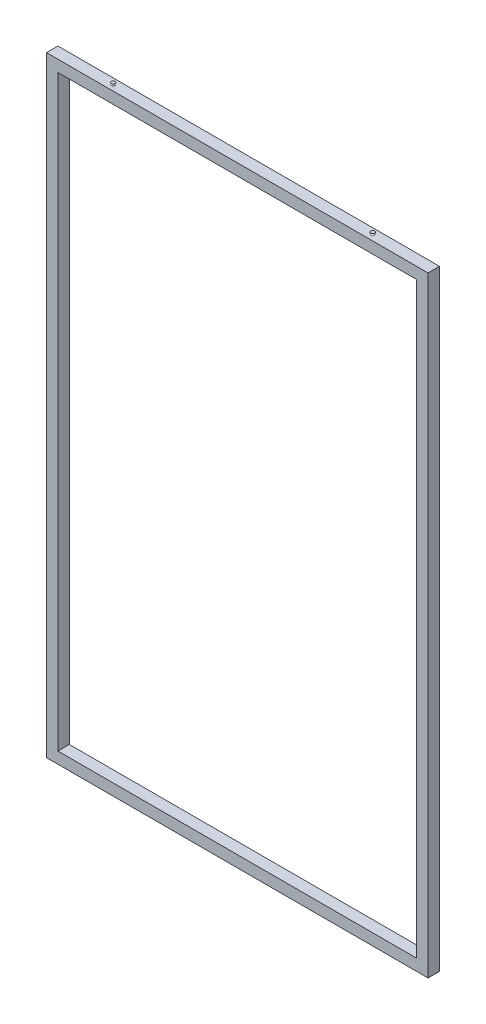
ISO-10303-21;
HEADER;
FILE_DESCRIPTION(('STEP AP214'),'2;1');
FILE_NAME('part.step','',(''),(''),'','','');
FILE_SCHEMA(('AUTOMOTIVE_DESIGN { 1 0 10303 214 1 1 1 1 }'));
ENDSEC;
DATA;
#1=APPLICATION_CONTEXT('core data for automotive mechanical design processes');
#2=APPLICATION_PROTOCOL_DEFINITION('international standard','automotive_design',2000,#1);
#3=PRODUCT_CONTEXT('',#1,'mechanical');
#4=PRODUCT('Part','Part','',(#3));
#5=PRODUCT_RELATED_PRODUCT_CATEGORY('part','',(#4));
#6=PRODUCT_DEFINITION_FORMATION('','',#4);
#7=PRODUCT_DEFINITION_CONTEXT('part definition',#1,'design');
#8=PRODUCT_DEFINITION('design','',#6,#7);
#9=PRODUCT_DEFINITION_SHAPE('','',#8);
#10=(LENGTH_UNIT() NAMED_UNIT(*) SI_UNIT(.MILLI.,.METRE.));
#11=(NAMED_UNIT(*) PLANE_ANGLE_UNIT() SI_UNIT($,.RADIAN.));
#12=(NAMED_UNIT(*) SI_UNIT($,.STERADIAN.) SOLID_ANGLE_UNIT());
#13=UNCERTAINTY_MEASURE_WITH_UNIT(LENGTH_MEASURE(1.E-05),#10,'distance_accuracy_value','');
#14=(GEOMETRIC_REPRESENTATION_CONTEXT(3) GLOBAL_UNCERTAINTY_ASSIGNED_CONTEXT((#13)) GLOBAL_UNIT_ASSIGNED_CONTEXT((#10,
#11,#12)) REPRESENTATION_CONTEXT('',''));
#15=CARTESIAN_POINT('',(0.,0.,0.));
#16=DIRECTION('',(0.,0.,1.));
#17=DIRECTION('',(1.,0.,0.));
#18=AXIS2_PLACEMENT_3D('',#15,#16,#17);
#19=CARTESIAN_POINT('',(0.,0.,15.));
#20=DIRECTION('',(0.,0.,1.));
#21=DIRECTION('',(1.,0.,0.));
#22=AXIS2_PLACEMENT_3D('',#19,#20,#21);
#23=PLANE('',#22);
#24=DIRECTION('',(0.,1.,0.));
#25=VECTOR('',#24,1.);
#26=CARTESIAN_POINT('',(500.,800.,15.));
#27=LINE('',#26,#25);
#28=CARTESIAN_POINT('',(500.,-800.,15.));
#29=VERTEX_POINT('',#28);
#30=CARTESIAN_POINT('',(500.,800.,15.));
#31=VERTEX_POINT('',#30);
#32=EDGE_CURVE('E310',#29,#31,#27,.T.);
#33=ORIENTED_EDGE('',*,*,#32,.T.);
#34=DIRECTION('',(-1.,0.,0.));
#35=VECTOR('',#34,1.);
#36=CARTESIAN_POINT('',(-500.,800.,15.));
#37=LINE('',#36,#35);
#38=CARTESIAN_POINT('',(-500.,800.,15.));
#39=VERTEX_POINT('',#38);
#40=EDGE_CURVE('E313',#31,#39,#37,.T.);
#41=ORIENTED_EDGE('',*,*,#40,.T.);
#42=DIRECTION('',(0.,-1.,0.));
#43=VECTOR('',#42,1.);
#44=CARTESIAN_POINT('',(-500.,800.,15.));
#45=LINE('',#44,#43);
#46=CARTESIAN_POINT('',(-500.,-800.,15.));
#47=VERTEX_POINT('',#46);
#48=EDGE_CURVE('E316',#39,#47,#45,.T.);
#49=ORIENTED_EDGE('',*,*,#48,.T.);
#50=DIRECTION('',(1.,0.,0.));
#51=VECTOR('',#50,1.);
#52=CARTESIAN_POINT('',(-500.,-800.,15.));
#53=LINE('',#52,#51);
#54=EDGE_CURVE('E318',#47,#29,#53,.T.);
#55=ORIENTED_EDGE('',*,*,#54,.T.);
#56=EDGE_LOOP('',(#33,#41,#49,#55));
#57=FACE_BOUND('',#56,.T.);
#58=DIRECTION('',(1.,0.,0.));
#59=VECTOR('',#58,1.);
#60=CARTESIAN_POINT('',(-470.,-770.,15.));
#61=LINE('',#60,#59);
#62=CARTESIAN_POINT('',(-470.,-770.,15.));
#63=VERTEX_POINT('',#62);
#64=CARTESIAN_POINT('',(470.,-770.,15.));
#65=VERTEX_POINT('',#64);
#66=EDGE_CURVE('E288',#63,#65,#61,.T.);
#67=ORIENTED_EDGE('',*,*,#66,.F.);
#68=DIRECTION('',(0.,-1.,0.));
#69=VECTOR('',#68,1.);
#70=CARTESIAN_POINT('',(-470.,770.,15.));
#71=LINE('',#70,#69);
#72=CARTESIAN_POINT('',(-470.,770.,15.));
#73=VERTEX_POINT('',#72);
#74=EDGE_CURVE('E286',#73,#63,#71,.T.);
#75=ORIENTED_EDGE('',*,*,#74,.F.);
#76=DIRECTION('',(-1.,0.,0.));
#77=VECTOR('',#76,1.);
#78=CARTESIAN_POINT('',(-470.,770.,15.));
#79=LINE('',#78,#77);
#80=CARTESIAN_POINT('',(470.,770.,15.));
#81=VERTEX_POINT('',#80);
#82=EDGE_CURVE('E293',#81,#73,#79,.T.);
#83=ORIENTED_EDGE('',*,*,#82,.F.);
#84=DIRECTION('',(0.,1.,0.));
#85=VECTOR('',#84,1.);
#86=CARTESIAN_POINT('',(470.,770.,15.));
#87=LINE('',#86,#85);
#88=EDGE_CURVE('E291',#65,#81,#87,.T.);
#89=ORIENTED_EDGE('',*,*,#88,.F.);
#90=EDGE_LOOP('',(#67,#75,#83,#89));
#91=FACE_BOUND('',#90,.T.);
#92=ADVANCED_FACE('F47',(#57,#91),#23,.T.);
#93=CARTESIAN_POINT('',(0.,0.,-15.));
#94=DIRECTION('',(0.,0.,1.));
#95=DIRECTION('',(1.,0.,0.));
#96=AXIS2_PLACEMENT_3D('',#93,#94,#95);
#97=PLANE('',#96);
#98=DIRECTION('',(0.,1.,0.));
#99=VECTOR('',#98,1.);
#100=CARTESIAN_POINT('',(500.,800.,-15.));
#101=LINE('',#100,#99);
#102=CARTESIAN_POINT('',(500.,-800.,-15.));
#103=VERTEX_POINT('',#102);
#104=CARTESIAN_POINT('',(500.,800.,-15.));
#105=VERTEX_POINT('',#104);
#106=EDGE_CURVE('E309',#103,#105,#101,.T.);
#107=ORIENTED_EDGE('',*,*,#106,.F.);
#108=DIRECTION('',(1.,0.,0.));
#109=VECTOR('',#108,1.);
#110=CARTESIAN_POINT('',(-500.,-800.,-15.));
#111=LINE('',#110,#109);
#112=CARTESIAN_POINT('',(-500.,-800.,-15.));
#113=VERTEX_POINT('',#112);
#114=EDGE_CURVE('E314',#113,#103,#111,.T.);
#115=ORIENTED_EDGE('',*,*,#114,.F.);
#116=DIRECTION('',(0.,-1.,0.));
#117=VECTOR('',#116,1.);
#118=CARTESIAN_POINT('',(-500.,800.,-15.));
#119=LINE('',#118,#117);
#120=CARTESIAN_POINT('',(-500.,800.,-15.));
#121=VERTEX_POINT('',#120);
#122=EDGE_CURVE('E325',#121,#113,#119,.T.);
#123=ORIENTED_EDGE('',*,*,#122,.F.);
#124=DIRECTION('',(-1.,0.,0.));
#125=VECTOR('',#124,1.);
#126=CARTESIAN_POINT('',(-500.,800.,-15.));
#127=LINE('',#126,#125);
#128=EDGE_CURVE('E323',#105,#121,#127,.T.);
#129=ORIENTED_EDGE('',*,*,#128,.F.);
#130=EDGE_LOOP('',(#107,#115,#123,#129));
#131=FACE_BOUND('',#130,.T.);
#132=DIRECTION('',(0.,-1.,0.));
#133=VECTOR('',#132,1.);
#134=CARTESIAN_POINT('',(-470.,770.,-15.));
#135=LINE('',#134,#133);
#136=CARTESIAN_POINT('',(-470.,770.,-15.));
#137=VERTEX_POINT('',#136);
#138=CARTESIAN_POINT('',(-470.,-770.,-15.));
#139=VERTEX_POINT('',#138);
#140=EDGE_CURVE('E70',#137,#139,#135,.T.);
#141=ORIENTED_EDGE('',*,*,#140,.T.);
#142=DIRECTION('',(1.,0.,0.));
#143=VECTOR('',#142,1.);
#144=CARTESIAN_POINT('',(-470.,-770.,-15.));
#145=LINE('',#144,#143);
#146=CARTESIAN_POINT('',(470.,-770.,-15.));
#147=VERTEX_POINT('',#146);
#148=EDGE_CURVE('E214',#139,#147,#145,.T.);
#149=ORIENTED_EDGE('',*,*,#148,.T.);
#150=DIRECTION('',(0.,1.,0.));
#151=VECTOR('',#150,1.);
#152=CARTESIAN_POINT('',(470.,770.,-15.));
#153=LINE('',#152,#151);
#154=CARTESIAN_POINT('',(470.,770.,-15.));
#155=VERTEX_POINT('',#154);
#156=EDGE_CURVE('E298',#147,#155,#153,.T.);
#157=ORIENTED_EDGE('',*,*,#156,.T.);
#158=DIRECTION('',(-1.,0.,0.));
#159=VECTOR('',#158,1.);
#160=CARTESIAN_POINT('',(-470.,770.,-15.));
#161=LINE('',#160,#159);
#162=EDGE_CURVE('E289',#155,#137,#161,.T.);
#163=ORIENTED_EDGE('',*,*,#162,.T.);
#164=EDGE_LOOP('',(#141,#149,#157,#163));
#165=FACE_BOUND('',#164,.T.);
#166=ADVANCED_FACE('F343',(#131,#165),#97,.F.);
#167=CARTESIAN_POINT('',(500.,800.,15.));
#168=DIRECTION('',(-1.,0.,0.));
#169=DIRECTION('',(0.,-1.,0.));
#170=AXIS2_PLACEMENT_3D('',#167,#168,#169);
#171=PLANE('',#170);
#172=ORIENTED_EDGE('',*,*,#106,.T.);
#173=DIRECTION('',(0.,0.,-1.));
#174=VECTOR('',#173,1.);
#175=CARTESIAN_POINT('',(500.,800.,15.));
#176=LINE('',#175,#174);
#177=EDGE_CURVE('E13',#31,#105,#176,.T.);
#178=ORIENTED_EDGE('',*,*,#177,.F.);
#179=ORIENTED_EDGE('',*,*,#32,.F.);
#180=DIRECTION('',(0.,0.,-1.));
#181=VECTOR('',#180,1.);
#182=CARTESIAN_POINT('',(500.,-800.,15.));
#183=LINE('',#182,#181);
#184=EDGE_CURVE('E320',#29,#103,#183,.T.);
#185=ORIENTED_EDGE('',*,*,#184,.T.);
#186=EDGE_LOOP('',(#172,#178,#179,#185));
#187=FACE_BOUND('',#186,.T.);
#188=ADVANCED_FACE('F49',(#187),#171,.F.);
#189=CARTESIAN_POINT('',(-500.,800.,15.));
#190=DIRECTION('',(0.,-1.,0.));
#191=DIRECTION('',(0.,0.,-1.));
#192=AXIS2_PLACEMENT_3D('',#189,#190,#191);
#193=PLANE('',#192);
#194=CARTESIAN_POINT('',(340.,800.,0.));
#195=DIRECTION('',(0.,1.,0.));
#196=DIRECTION('',(0.,0.,-1.));
#197=AXIS2_PLACEMENT_3D('',#194,#195,#196);
#198=CIRCLE('',#197,5.);
#199=CARTESIAN_POINT('',(340.,800.,-5.));
#200=VERTEX_POINT('',#199);
#201=EDGE_CURVE('E485',#200,#200,#198,.T.);
#202=ORIENTED_EDGE('',*,*,#201,.F.);
#203=EDGE_LOOP('',(#202));
#204=FACE_BOUND('',#203,.T.);
#205=CARTESIAN_POINT('',(-340.,800.,0.));
#206=DIRECTION('',(0.,-1.,0.));
#207=DIRECTION('',(0.,0.,-1.));
#208=AXIS2_PLACEMENT_3D('',#205,#206,#207);
#209=CIRCLE('',#208,5.);
#210=CARTESIAN_POINT('',(-340.,800.,-5.));
#211=VERTEX_POINT('',#210);
#212=EDGE_CURVE('E489',#211,#211,#209,.T.);
#213=ORIENTED_EDGE('',*,*,#212,.T.);
#214=EDGE_LOOP('',(#213));
#215=FACE_BOUND('',#214,.T.);
#216=ORIENTED_EDGE('',*,*,#128,.T.);
#217=DIRECTION('',(0.,0.,-1.));
#218=VECTOR('',#217,1.);
#219=CARTESIAN_POINT('',(-500.,800.,15.));
#220=LINE('',#219,#218);
#221=EDGE_CURVE('E55',#39,#121,#220,.T.);
#222=ORIENTED_EDGE('',*,*,#221,.F.);
#223=ORIENTED_EDGE('',*,*,#40,.F.);
#224=ORIENTED_EDGE('',*,*,#177,.T.);
#225=EDGE_LOOP('',(#216,#222,#223,#224));
#226=FACE_BOUND('',#225,.T.);
#227=ADVANCED_FACE('F354',(#204,#215,#226),#193,.F.);
#228=CARTESIAN_POINT('',(-500.,800.,15.));
#229=DIRECTION('',(1.,0.,0.));
#230=DIRECTION('',(0.,1.,0.));
#231=AXIS2_PLACEMENT_3D('',#228,#229,#230);
#232=PLANE('',#231);
#233=ORIENTED_EDGE('',*,*,#122,.T.);
#234=DIRECTION('',(0.,0.,-1.));
#235=VECTOR('',#234,1.);
#236=CARTESIAN_POINT('',(-500.,-800.,15.));
#237=LINE('',#236,#235);
#238=EDGE_CURVE('E330',#47,#113,#237,.T.);
#239=ORIENTED_EDGE('',*,*,#238,.F.);
#240=ORIENTED_EDGE('',*,*,#48,.F.);
#241=ORIENTED_EDGE('',*,*,#221,.T.);
#242=EDGE_LOOP('',(#233,#239,#240,#241));
#243=FACE_BOUND('',#242,.T.);
#244=ADVANCED_FACE('F337',(#243),#232,.F.);
#245=CARTESIAN_POINT('',(-500.,-800.,15.));
#246=DIRECTION('',(0.,1.,0.));
#247=DIRECTION('',(0.,0.,1.));
#248=AXIS2_PLACEMENT_3D('',#245,#246,#247);
#249=PLANE('',#248);
#250=ORIENTED_EDGE('',*,*,#114,.T.);
#251=ORIENTED_EDGE('',*,*,#184,.F.);
#252=ORIENTED_EDGE('',*,*,#54,.F.);
#253=ORIENTED_EDGE('',*,*,#238,.T.);
#254=EDGE_LOOP('',(#250,#251,#252,#253));
#255=FACE_BOUND('',#254,.T.);
#256=ADVANCED_FACE('F347',(#255),#249,.F.);
#257=CARTESIAN_POINT('',(-470.,770.,15.));
#258=DIRECTION('',(1.,0.,0.));
#259=DIRECTION('',(0.,1.,0.));
#260=AXIS2_PLACEMENT_3D('',#257,#258,#259);
#261=PLANE('',#260);
#262=ORIENTED_EDGE('',*,*,#140,.F.);
#263=DIRECTION('',(0.,0.,-1.));
#264=VECTOR('',#263,1.);
#265=CARTESIAN_POINT('',(-470.,770.,15.));
#266=LINE('',#265,#264);
#267=EDGE_CURVE('E294',#73,#137,#266,.T.);
#268=ORIENTED_EDGE('',*,*,#267,.F.);
#269=ORIENTED_EDGE('',*,*,#74,.T.);
#270=DIRECTION('',(0.,0.,-1.));
#271=VECTOR('',#270,1.);
#272=CARTESIAN_POINT('',(-470.,-770.,15.));
#273=LINE('',#272,#271);
#274=EDGE_CURVE('E307',#63,#139,#273,.T.);
#275=ORIENTED_EDGE('',*,*,#274,.T.);
#276=EDGE_LOOP('',(#262,#268,#269,#275));
#277=FACE_BOUND('',#276,.T.);
#278=ADVANCED_FACE('F371',(#277),#261,.T.);
#279=CARTESIAN_POINT('',(-470.,-770.,15.));
#280=DIRECTION('',(0.,1.,0.));
#281=DIRECTION('',(0.,0.,1.));
#282=AXIS2_PLACEMENT_3D('',#279,#280,#281);
#283=PLANE('',#282);
#284=ORIENTED_EDGE('',*,*,#148,.F.);
#285=ORIENTED_EDGE('',*,*,#274,.F.);
#286=ORIENTED_EDGE('',*,*,#66,.T.);
#287=DIRECTION('',(0.,0.,-1.));
#288=VECTOR('',#287,1.);
#289=CARTESIAN_POINT('',(470.,-770.,15.));
#290=LINE('',#289,#288);
#291=EDGE_CURVE('E305',#65,#147,#290,.T.);
#292=ORIENTED_EDGE('',*,*,#291,.T.);
#293=EDGE_LOOP('',(#284,#285,#286,#292));
#294=FACE_BOUND('',#293,.T.);
#295=ADVANCED_FACE('F378',(#294),#283,.T.);
#296=CARTESIAN_POINT('',(470.,770.,15.));
#297=DIRECTION('',(-1.,0.,0.));
#298=DIRECTION('',(0.,-1.,0.));
#299=AXIS2_PLACEMENT_3D('',#296,#297,#298);
#300=PLANE('',#299);
#301=ORIENTED_EDGE('',*,*,#156,.F.);
#302=ORIENTED_EDGE('',*,*,#291,.F.);
#303=ORIENTED_EDGE('',*,*,#88,.T.);
#304=DIRECTION('',(0.,0.,-1.));
#305=VECTOR('',#304,1.);
#306=CARTESIAN_POINT('',(470.,770.,15.));
#307=LINE('',#306,#305);
#308=EDGE_CURVE('E62',#81,#155,#307,.T.);
#309=ORIENTED_EDGE('',*,*,#308,.T.);
#310=EDGE_LOOP('',(#301,#302,#303,#309));
#311=FACE_BOUND('',#310,.T.);
#312=ADVANCED_FACE('F382',(#311),#300,.T.);
#313=CARTESIAN_POINT('',(-470.,770.,15.));
#314=DIRECTION('',(0.,-1.,0.));
#315=DIRECTION('',(0.,0.,-1.));
#316=AXIS2_PLACEMENT_3D('',#313,#314,#315);
#317=PLANE('',#316);
#318=ORIENTED_EDGE('',*,*,#162,.F.);
#319=ORIENTED_EDGE('',*,*,#308,.F.);
#320=ORIENTED_EDGE('',*,*,#82,.T.);
#321=ORIENTED_EDGE('',*,*,#267,.T.);
#322=EDGE_LOOP('',(#318,#319,#320,#321));
#323=FACE_BOUND('',#322,.T.);
#324=ADVANCED_FACE('F387',(#323),#317,.T.);
#325=CARTESIAN_POINT('',(-345.,805.,0.));
#326=DIRECTION('',(0.,-1.,0.));
#327=DIRECTION('',(0.,0.,-1.));
#328=AXIS2_PLACEMENT_3D('',#325,#326,#327);
#329=PLANE('',#328);
#330=CARTESIAN_POINT('',(-340.,805.,0.));
#331=DIRECTION('',(0.,-1.,0.));
#332=DIRECTION('',(0.,0.,-1.));
#333=AXIS2_PLACEMENT_3D('',#330,#331,#332);
#334=CIRCLE('',#333,5.);
#335=CARTESIAN_POINT('',(-340.,805.,-5.));
#336=VERTEX_POINT('',#335);
#337=EDGE_CURVE('E278',#336,#336,#334,.T.);
#338=ORIENTED_EDGE('',*,*,#337,.F.);
#339=EDGE_LOOP('',(#338));
#340=FACE_BOUND('',#339,.T.);
#341=ADVANCED_FACE('F393',(#340),#329,.F.);
#342=CARTESIAN_POINT('',(-340.,802.5,0.));
#343=DIRECTION('',(0.,-1.,0.));
#344=DIRECTION('',(0.,0.,-1.));
#345=AXIS2_PLACEMENT_3D('',#342,#343,#344);
#346=TOROIDAL_SURFACE('',#345,5.,2.49999999999995);
#347=ORIENTED_EDGE('',*,*,#212,.F.);
#348=EDGE_LOOP('',(#347));
#349=FACE_BOUND('',#348,.T.);
#350=ORIENTED_EDGE('',*,*,#337,.T.);
#351=EDGE_LOOP('',(#350));
#352=FACE_BOUND('',#351,.T.);
#353=ADVANCED_FACE('F469',(#349,#352),#346,.F.);
#354=CARTESIAN_POINT('',(345.,805.,0.));
#355=DIRECTION('',(0.,-1.,0.));
#356=DIRECTION('',(0.,0.,-1.));
#357=AXIS2_PLACEMENT_3D('',#354,#355,#356);
#358=PLANE('',#357);
#359=CARTESIAN_POINT('',(340.,805.,0.));
#360=DIRECTION('',(0.,1.,0.));
#361=DIRECTION('',(0.,0.,-1.));
#362=AXIS2_PLACEMENT_3D('',#359,#360,#361);
#363=CIRCLE('',#362,5.);
#364=CARTESIAN_POINT('',(340.,805.,-5.));
#365=VERTEX_POINT('',#364);
#366=EDGE_CURVE('E488',#365,#365,#363,.T.);
#367=ORIENTED_EDGE('',*,*,#366,.T.);
#368=EDGE_LOOP('',(#367));
#369=FACE_BOUND('',#368,.T.);
#370=ADVANCED_FACE('F473',(#369),#358,.F.);
#371=CARTESIAN_POINT('',(340.,802.5,0.));
#372=DIRECTION('',(0.,-1.,0.));
#373=DIRECTION('',(0.,0.,-1.));
#374=AXIS2_PLACEMENT_3D('',#371,#372,#373);
#375=TOROIDAL_SURFACE('',#374,5.,2.49999999999995);
#376=ORIENTED_EDGE('',*,*,#201,.T.);
#377=EDGE_LOOP('',(#376));
#378=FACE_BOUND('',#377,.T.);
#379=ORIENTED_EDGE('',*,*,#366,.F.);
#380=EDGE_LOOP('',(#379));
#381=FACE_BOUND('',#380,.T.);
#382=ADVANCED_FACE('F477',(#378,#381),#375,.F.);
#383=CLOSED_SHELL('',(#92,#166,#188,#227,#244,#256,#278,#295,#312,#324,#341,#353,#370,#382));
#384=CARTESIAN_POINT('',(-498.,-799.4,13.));
#385=DIRECTION('',(0.,0.,1.));
#386=DIRECTION('',(1.,0.,0.));
#387=AXIS2_PLACEMENT_3D('',#384,#385,#386);
#388=PLANE('',#387);
#389=DIRECTION('',(0.,1.,0.));
#390=VECTOR('',#389,1.);
#391=CARTESIAN_POINT('',(-472.,-799.4,13.));
#392=LINE('',#391,#390);
#393=CARTESIAN_POINT('',(-472.,-772.,13.));
#394=VERTEX_POINT('',#393);
#395=CARTESIAN_POINT('',(-472.,772.,13.));
#396=VERTEX_POINT('',#395);
#397=EDGE_CURVE('E247',#394,#396,#392,.T.);
#398=ORIENTED_EDGE('',*,*,#397,.F.);
#399=DIRECTION('',(-0.707106781186548,-0.707106781186548,0.));
#400=VECTOR('',#399,1.);
#401=CARTESIAN_POINT('',(0.700000000000089,-299.3,13.));
#402=LINE('',#401,#400);
#403=CARTESIAN_POINT('',(-498.,-798.,13.));
#404=VERTEX_POINT('',#403);
#405=EDGE_CURVE('E225',#394,#404,#402,.T.);
#406=ORIENTED_EDGE('',*,*,#405,.T.);
#407=DIRECTION('',(0.,1.,0.));
#408=VECTOR('',#407,1.);
#409=CARTESIAN_POINT('',(-498.,-799.4,13.));
#410=LINE('',#409,#408);
#411=CARTESIAN_POINT('',(-498.,798.,13.));
#412=VERTEX_POINT('',#411);
#413=EDGE_CURVE('E274',#404,#412,#410,.T.);
#414=ORIENTED_EDGE('',*,*,#413,.T.);
#415=DIRECTION('',(-0.707106781186548,0.707106781186548,0.));
#416=VECTOR('',#415,1.);
#417=CARTESIAN_POINT('',(-498.7,798.7,13.));
#418=LINE('',#417,#416);
#419=EDGE_CURVE('E254',#396,#412,#418,.T.);
#420=ORIENTED_EDGE('',*,*,#419,.F.);
#421=EDGE_LOOP('',(#398,#406,#414,#420));
#422=FACE_BOUND('',#421,.T.);
#423=ADVANCED_FACE('F394',(#422),#388,.F.);
#424=CARTESIAN_POINT('',(-498.,-799.4,13.));
#425=DIRECTION('',(-1.,0.,0.));
#426=DIRECTION('',(0.,0.,1.));
#427=AXIS2_PLACEMENT_3D('',#424,#425,#426);
#428=PLANE('',#427);
#429=ORIENTED_EDGE('',*,*,#413,.F.);
#430=DIRECTION('',(0.,0.,-1.));
#431=VECTOR('',#430,1.);
#432=CARTESIAN_POINT('',(-498.,-798.,13.));
#433=LINE('',#432,#431);
#434=CARTESIAN_POINT('',(-498.,-798.,-13.));
#435=VERTEX_POINT('',#434);
#436=EDGE_CURVE('E222',#404,#435,#433,.T.);
#437=ORIENTED_EDGE('',*,*,#436,.T.);
#438=DIRECTION('',(0.,1.,0.));
#439=VECTOR('',#438,1.);
#440=CARTESIAN_POINT('',(-498.,-799.4,-13.));
#441=LINE('',#440,#439);
#442=CARTESIAN_POINT('',(-498.,798.,-13.));
#443=VERTEX_POINT('',#442);
#444=EDGE_CURVE('E277',#435,#443,#441,.T.);
#445=ORIENTED_EDGE('',*,*,#444,.T.);
#446=DIRECTION('',(0.,0.,-1.));
#447=VECTOR('',#446,1.);
#448=CARTESIAN_POINT('',(-498.,798.,13.));
#449=LINE('',#448,#447);
#450=EDGE_CURVE('E256',#412,#443,#449,.T.);
#451=ORIENTED_EDGE('',*,*,#450,.F.);
#452=EDGE_LOOP('',(#429,#437,#445,#451));
#453=FACE_BOUND('',#452,.T.);
#454=ADVANCED_FACE('F397',(#453),#428,.F.);
#455=CARTESIAN_POINT('',(-498.,-799.4,-13.));
#456=DIRECTION('',(0.,0.,-1.));
#457=DIRECTION('',(-1.,0.,0.));
#458=AXIS2_PLACEMENT_3D('',#455,#456,#457);
#459=PLANE('',#458);
#460=ORIENTED_EDGE('',*,*,#444,.F.);
#461=DIRECTION('',(0.707106781186548,0.707106781186548,0.));
#462=VECTOR('',#461,1.);
#463=CARTESIAN_POINT('',(0.700000000000089,-299.3,-13.));
#464=LINE('',#463,#462);
#465=CARTESIAN_POINT('',(-472.,-772.,-13.));
#466=VERTEX_POINT('',#465);
#467=EDGE_CURVE('E207',#435,#466,#464,.T.);
#468=ORIENTED_EDGE('',*,*,#467,.T.);
#469=DIRECTION('',(0.,1.,0.));
#470=VECTOR('',#469,1.);
#471=CARTESIAN_POINT('',(-472.,-799.4,-13.));
#472=LINE('',#471,#470);
#473=CARTESIAN_POINT('',(-472.,772.,-13.));
#474=VERTEX_POINT('',#473);
#475=EDGE_CURVE('E281',#466,#474,#472,.T.);
#476=ORIENTED_EDGE('',*,*,#475,.T.);
#477=DIRECTION('',(0.707106781186548,-0.707106781186548,0.));
#478=VECTOR('',#477,1.);
#479=CARTESIAN_POINT('',(-498.7,798.7,-13.));
#480=LINE('',#479,#478);
#481=EDGE_CURVE('E258',#443,#474,#480,.T.);
#482=ORIENTED_EDGE('',*,*,#481,.F.);
#483=EDGE_LOOP('',(#460,#468,#476,#482));
#484=FACE_BOUND('',#483,.T.);
#485=ADVANCED_FACE('F402',(#484),#459,.F.);
#486=CARTESIAN_POINT('',(-472.,-799.4,13.));
#487=DIRECTION('',(1.,0.,0.));
#488=DIRECTION('',(0.,0.,-1.));
#489=AXIS2_PLACEMENT_3D('',#486,#487,#488);
#490=PLANE('',#489);
#491=ORIENTED_EDGE('',*,*,#475,.F.);
#492=DIRECTION('',(0.,0.,1.));
#493=VECTOR('',#492,1.);
#494=CARTESIAN_POINT('',(-472.,-772.,13.));
#495=LINE('',#494,#493);
#496=EDGE_CURVE('E228',#466,#394,#495,.T.);
#497=ORIENTED_EDGE('',*,*,#496,.T.);
#498=ORIENTED_EDGE('',*,*,#397,.T.);
#499=DIRECTION('',(0.,0.,1.));
#500=VECTOR('',#499,1.);
#501=CARTESIAN_POINT('',(-472.,772.,13.));
#502=LINE('',#501,#500);
#503=EDGE_CURVE('E233',#474,#396,#502,.T.);
#504=ORIENTED_EDGE('',*,*,#503,.F.);
#505=EDGE_LOOP('',(#491,#497,#498,#504));
#506=FACE_BOUND('',#505,.T.);
#507=ADVANCED_FACE('F406',(#506),#490,.F.);
#508=CARTESIAN_POINT('',(-499.4,772.,13.));
#509=DIRECTION('',(0.,-1.,0.));
#510=DIRECTION('',(0.,0.,-1.));
#511=AXIS2_PLACEMENT_3D('',#508,#509,#510);
#512=PLANE('',#511);
#513=ORIENTED_EDGE('',*,*,#503,.T.);
#514=DIRECTION('',(1.,0.,0.));
#515=VECTOR('',#514,1.);
#516=CARTESIAN_POINT('',(-499.4,772.,13.));
#517=LINE('',#516,#515);
#518=CARTESIAN_POINT('',(0.,772.,13.));
#519=VERTEX_POINT('',#518);
#520=EDGE_CURVE('E244',#396,#519,#517,.T.);
#521=ORIENTED_EDGE('',*,*,#520,.T.);
#522=DIRECTION('',(0.,0.,-1.));
#523=VECTOR('',#522,1.);
#524=CARTESIAN_POINT('',(0.,772.,13.));
#525=LINE('',#524,#523);
#526=CARTESIAN_POINT('',(0.,772.,-13.));
#527=VERTEX_POINT('',#526);
#528=EDGE_CURVE('E193',#519,#527,#525,.T.);
#529=ORIENTED_EDGE('',*,*,#528,.T.);
#530=DIRECTION('',(1.,0.,0.));
#531=VECTOR('',#530,1.);
#532=CARTESIAN_POINT('',(-499.4,772.,-13.));
#533=LINE('',#532,#531);
#534=EDGE_CURVE('E246',#474,#527,#533,.T.);
#535=ORIENTED_EDGE('',*,*,#534,.F.);
#536=EDGE_LOOP('',(#513,#521,#529,#535));
#537=FACE_BOUND('',#536,.T.);
#538=ADVANCED_FACE('F410',(#537),#512,.F.);
#539=CARTESIAN_POINT('',(-499.4,798.,-13.));
#540=DIRECTION('',(0.,0.,-1.));
#541=DIRECTION('',(0.,1.,0.));
#542=AXIS2_PLACEMENT_3D('',#539,#540,#541);
#543=PLANE('',#542);
#544=ORIENTED_EDGE('',*,*,#481,.T.);
#545=ORIENTED_EDGE('',*,*,#534,.T.);
#546=DIRECTION('',(0.,1.,0.));
#547=VECTOR('',#546,1.);
#548=CARTESIAN_POINT('',(0.,798.,-13.));
#549=LINE('',#548,#547);
#550=CARTESIAN_POINT('',(0.,798.,-13.));
#551=VERTEX_POINT('',#550);
#552=EDGE_CURVE('E261',#527,#551,#549,.T.);
#553=ORIENTED_EDGE('',*,*,#552,.T.);
#554=DIRECTION('',(1.,0.,0.));
#555=VECTOR('',#554,1.);
#556=CARTESIAN_POINT('',(-499.4,798.,-13.));
#557=LINE('',#556,#555);
#558=EDGE_CURVE('E249',#443,#551,#557,.T.);
#559=ORIENTED_EDGE('',*,*,#558,.F.);
#560=EDGE_LOOP('',(#544,#545,#553,#559));
#561=FACE_BOUND('',#560,.T.);
#562=ADVANCED_FACE('F428',(#561),#543,.F.);
#563=CARTESIAN_POINT('',(-499.4,798.,13.));
#564=DIRECTION('',(0.,1.,0.));
#565=DIRECTION('',(0.,0.,1.));
#566=AXIS2_PLACEMENT_3D('',#563,#564,#565);
#567=PLANE('',#566);
#568=ORIENTED_EDGE('',*,*,#450,.T.);
#569=ORIENTED_EDGE('',*,*,#558,.T.);
#570=DIRECTION('',(0.,0.,1.));
#571=VECTOR('',#570,1.);
#572=CARTESIAN_POINT('',(0.,798.,13.));
#573=LINE('',#572,#571);
#574=CARTESIAN_POINT('',(0.,798.,13.));
#575=VERTEX_POINT('',#574);
#576=EDGE_CURVE('E264',#551,#575,#573,.T.);
#577=ORIENTED_EDGE('',*,*,#576,.T.);
#578=DIRECTION('',(1.,0.,0.));
#579=VECTOR('',#578,1.);
#580=CARTESIAN_POINT('',(-499.4,798.,13.));
#581=LINE('',#580,#579);
#582=EDGE_CURVE('E251',#412,#575,#581,.T.);
#583=ORIENTED_EDGE('',*,*,#582,.F.);
#584=EDGE_LOOP('',(#568,#569,#577,#583));
#585=FACE_BOUND('',#584,.T.);
#586=ADVANCED_FACE('F432',(#585),#567,.F.);
#587=CARTESIAN_POINT('',(-499.4,798.,13.));
#588=DIRECTION('',(0.,0.,1.));
#589=DIRECTION('',(1.,0.,0.));
#590=AXIS2_PLACEMENT_3D('',#587,#588,#589);
#591=PLANE('',#590);
#592=ORIENTED_EDGE('',*,*,#419,.T.);
#593=ORIENTED_EDGE('',*,*,#582,.T.);
#594=DIRECTION('',(0.,-1.,0.));
#595=VECTOR('',#594,1.);
#596=CARTESIAN_POINT('',(0.,798.,13.));
#597=LINE('',#596,#595);
#598=EDGE_CURVE('E198',#575,#519,#597,.T.);
#599=ORIENTED_EDGE('',*,*,#598,.T.);
#600=ORIENTED_EDGE('',*,*,#520,.F.);
#601=EDGE_LOOP('',(#592,#593,#599,#600));
#602=FACE_BOUND('',#601,.T.);
#603=ADVANCED_FACE('F425',(#602),#591,.F.);
#604=CARTESIAN_POINT('',(0.,772.,13.));
#605=DIRECTION('',(0.,-1.,0.));
#606=DIRECTION('',(0.,0.,-1.));
#607=AXIS2_PLACEMENT_3D('',#604,#605,#606);
#608=PLANE('',#607);
#609=DIRECTION('',(1.,0.,0.));
#610=VECTOR('',#609,1.);
#611=CARTESIAN_POINT('',(0.,772.,-13.));
#612=LINE('',#611,#610);
#613=CARTESIAN_POINT('',(472.,772.,-13.));
#614=VERTEX_POINT('',#613);
#615=EDGE_CURVE('E197',#527,#614,#612,.T.);
#616=ORIENTED_EDGE('',*,*,#615,.F.);
#617=ORIENTED_EDGE('',*,*,#528,.F.);
#618=DIRECTION('',(1.,0.,0.));
#619=VECTOR('',#618,1.);
#620=CARTESIAN_POINT('',(0.,772.,13.));
#621=LINE('',#620,#619);
#622=CARTESIAN_POINT('',(472.,772.,13.));
#623=VERTEX_POINT('',#622);
#624=EDGE_CURVE('E189',#519,#623,#621,.T.);
#625=ORIENTED_EDGE('',*,*,#624,.T.);
#626=DIRECTION('',(0.,0.,1.));
#627=VECTOR('',#626,1.);
#628=CARTESIAN_POINT('',(472.,772.,13.));
#629=LINE('',#628,#627);
#630=EDGE_CURVE('E175',#614,#623,#629,.T.);
#631=ORIENTED_EDGE('',*,*,#630,.F.);
#632=EDGE_LOOP('',(#616,#617,#625,#631));
#633=FACE_BOUND('',#632,.T.);
#634=ADVANCED_FACE('F191',(#633),#608,.F.);
#635=CARTESIAN_POINT('',(0.,798.,-13.));
#636=DIRECTION('',(0.,0.,-1.));
#637=DIRECTION('',(0.,1.,0.));
#638=AXIS2_PLACEMENT_3D('',#635,#636,#637);
#639=PLANE('',#638);
#640=DIRECTION('',(1.,0.,0.));
#641=VECTOR('',#640,1.);
#642=CARTESIAN_POINT('',(0.,798.,-13.));
#643=LINE('',#642,#641);
#644=CARTESIAN_POINT('',(498.,798.,-13.));
#645=VERTEX_POINT('',#644);
#646=EDGE_CURVE('E270',#551,#645,#643,.T.);
#647=ORIENTED_EDGE('',*,*,#646,.F.);
#648=ORIENTED_EDGE('',*,*,#552,.F.);
#649=ORIENTED_EDGE('',*,*,#615,.T.);
#650=DIRECTION('',(-0.707106781186548,-0.707106781186548,0.));
#651=VECTOR('',#650,1.);
#652=CARTESIAN_POINT('',(498.7,798.7,-13.));
#653=LINE('',#652,#651);
#654=EDGE_CURVE('E184',#645,#614,#653,.T.);
#655=ORIENTED_EDGE('',*,*,#654,.F.);
#656=EDGE_LOOP('',(#647,#648,#649,#655));
#657=FACE_BOUND('',#656,.T.);
#658=ADVANCED_FACE('F418',(#657),#639,.F.);
#659=CARTESIAN_POINT('',(0.,798.,13.));
#660=DIRECTION('',(0.,1.,0.));
#661=DIRECTION('',(0.,0.,1.));
#662=AXIS2_PLACEMENT_3D('',#659,#660,#661);
#663=PLANE('',#662);
#664=DIRECTION('',(1.,0.,0.));
#665=VECTOR('',#664,1.);
#666=CARTESIAN_POINT('',(0.,798.,13.));
#667=LINE('',#666,#665);
#668=CARTESIAN_POINT('',(498.,798.,13.));
#669=VERTEX_POINT('',#668);
#670=EDGE_CURVE('E203',#575,#669,#667,.T.);
#671=ORIENTED_EDGE('',*,*,#670,.F.);
#672=ORIENTED_EDGE('',*,*,#576,.F.);
#673=ORIENTED_EDGE('',*,*,#646,.T.);
#674=DIRECTION('',(0.,0.,-1.));
#675=VECTOR('',#674,1.);
#676=CARTESIAN_POINT('',(498.,798.,13.));
#677=LINE('',#676,#675);
#678=EDGE_CURVE('E507',#669,#645,#677,.T.);
#679=ORIENTED_EDGE('',*,*,#678,.F.);
#680=EDGE_LOOP('',(#671,#672,#673,#679));
#681=FACE_BOUND('',#680,.T.);
#682=ADVANCED_FACE('F415',(#681),#663,.F.);
#683=CARTESIAN_POINT('',(0.,798.,13.));
#684=DIRECTION('',(0.,0.,1.));
#685=DIRECTION('',(1.,0.,0.));
#686=AXIS2_PLACEMENT_3D('',#683,#684,#685);
#687=PLANE('',#686);
#688=ORIENTED_EDGE('',*,*,#624,.F.);
#689=ORIENTED_EDGE('',*,*,#598,.F.);
#690=ORIENTED_EDGE('',*,*,#670,.T.);
#691=DIRECTION('',(0.707106781186548,0.707106781186548,0.));
#692=VECTOR('',#691,1.);
#693=CARTESIAN_POINT('',(498.7,798.7,13.));
#694=LINE('',#693,#692);
#695=EDGE_CURVE('E185',#623,#669,#694,.T.);
#696=ORIENTED_EDGE('',*,*,#695,.F.);
#697=EDGE_LOOP('',(#688,#689,#690,#696));
#698=FACE_BOUND('',#697,.T.);
#699=ADVANCED_FACE('F201',(#698),#687,.F.);
#700=CARTESIAN_POINT('',(499.4,-798.,13.));
#701=DIRECTION('',(0.,0.,1.));
#702=DIRECTION('',(1.,0.,0.));
#703=AXIS2_PLACEMENT_3D('',#700,#701,#702);
#704=PLANE('',#703);
#705=DIRECTION('',(-1.,0.,0.));
#706=VECTOR('',#705,1.);
#707=CARTESIAN_POINT('',(499.4,-772.,13.));
#708=LINE('',#707,#706);
#709=CARTESIAN_POINT('',(472.,-772.,13.));
#710=VERTEX_POINT('',#709);
#711=EDGE_CURVE('E239',#710,#394,#708,.T.);
#712=ORIENTED_EDGE('',*,*,#711,.F.);
#713=DIRECTION('',(0.707106781186548,-0.707106781186548,0.));
#714=VECTOR('',#713,1.);
#715=CARTESIAN_POINT('',(-300.7,0.699999999999923,13.));
#716=LINE('',#715,#714);
#717=CARTESIAN_POINT('',(498.,-798.,13.));
#718=VERTEX_POINT('',#717);
#719=EDGE_CURVE('E211',#710,#718,#716,.T.);
#720=ORIENTED_EDGE('',*,*,#719,.T.);
#721=DIRECTION('',(-1.,0.,0.));
#722=VECTOR('',#721,1.);
#723=CARTESIAN_POINT('',(499.4,-798.,13.));
#724=LINE('',#723,#722);
#725=EDGE_CURVE('E229',#718,#404,#724,.T.);
#726=ORIENTED_EDGE('',*,*,#725,.T.);
#727=ORIENTED_EDGE('',*,*,#405,.F.);
#728=EDGE_LOOP('',(#712,#720,#726,#727));
#729=FACE_BOUND('',#728,.T.);
#730=ADVANCED_FACE('F414',(#729),#704,.F.);
#731=CARTESIAN_POINT('',(499.4,-798.,13.));
#732=DIRECTION('',(0.,-1.,0.));
#733=DIRECTION('',(0.,0.,-1.));
#734=AXIS2_PLACEMENT_3D('',#731,#732,#733);
#735=PLANE('',#734);
#736=ORIENTED_EDGE('',*,*,#725,.F.);
#737=DIRECTION('',(0.,0.,-1.));
#738=VECTOR('',#737,1.);
#739=CARTESIAN_POINT('',(498.,-798.,13.));
#740=LINE('',#739,#738);
#741=CARTESIAN_POINT('',(498.,-798.,-13.));
#742=VERTEX_POINT('',#741);
#743=EDGE_CURVE('E502',#718,#742,#740,.T.);
#744=ORIENTED_EDGE('',*,*,#743,.T.);
#745=DIRECTION('',(-1.,0.,0.));
#746=VECTOR('',#745,1.);
#747=CARTESIAN_POINT('',(499.4,-798.,-13.));
#748=LINE('',#747,#746);
#749=EDGE_CURVE('E232',#742,#435,#748,.T.);
#750=ORIENTED_EDGE('',*,*,#749,.T.);
#751=ORIENTED_EDGE('',*,*,#436,.F.);
#752=EDGE_LOOP('',(#736,#744,#750,#751));
#753=FACE_BOUND('',#752,.T.);
#754=ADVANCED_FACE('F442',(#753),#735,.F.);
#755=CARTESIAN_POINT('',(499.4,-798.,-13.));
#756=DIRECTION('',(0.,0.,-1.));
#757=DIRECTION('',(0.,1.,0.));
#758=AXIS2_PLACEMENT_3D('',#755,#756,#757);
#759=PLANE('',#758);
#760=ORIENTED_EDGE('',*,*,#749,.F.);
#761=DIRECTION('',(-0.707106781186548,0.707106781186548,0.));
#762=VECTOR('',#761,1.);
#763=CARTESIAN_POINT('',(-300.7,0.699999999999923,-12.9999999999999));
#764=LINE('',#763,#762);
#765=CARTESIAN_POINT('',(472.,-772.,-13.));
#766=VERTEX_POINT('',#765);
#767=EDGE_CURVE('E505',#742,#766,#764,.T.);
#768=ORIENTED_EDGE('',*,*,#767,.T.);
#769=DIRECTION('',(-1.,0.,0.));
#770=VECTOR('',#769,1.);
#771=CARTESIAN_POINT('',(499.4,-772.,-13.));
#772=LINE('',#771,#770);
#773=EDGE_CURVE('E236',#766,#466,#772,.T.);
#774=ORIENTED_EDGE('',*,*,#773,.T.);
#775=ORIENTED_EDGE('',*,*,#467,.F.);
#776=EDGE_LOOP('',(#760,#768,#774,#775));
#777=FACE_BOUND('',#776,.T.);
#778=ADVANCED_FACE('F446',(#777),#759,.F.);
#779=CARTESIAN_POINT('',(499.4,-772.,13.));
#780=DIRECTION('',(0.,1.,0.));
#781=DIRECTION('',(0.,0.,1.));
#782=AXIS2_PLACEMENT_3D('',#779,#780,#781);
#783=PLANE('',#782);
#784=ORIENTED_EDGE('',*,*,#773,.F.);
#785=DIRECTION('',(0.,0.,1.));
#786=VECTOR('',#785,1.);
#787=CARTESIAN_POINT('',(472.,-772.,13.));
#788=LINE('',#787,#786);
#789=EDGE_CURVE('E497',#766,#710,#788,.T.);
#790=ORIENTED_EDGE('',*,*,#789,.T.);
#791=ORIENTED_EDGE('',*,*,#711,.T.);
#792=ORIENTED_EDGE('',*,*,#496,.F.);
#793=EDGE_LOOP('',(#784,#790,#791,#792));
#794=FACE_BOUND('',#793,.T.);
#795=ADVANCED_FACE('F450',(#794),#783,.F.);
#796=CARTESIAN_POINT('',(498.,799.4,13.));
#797=DIRECTION('',(0.,0.,1.));
#798=DIRECTION('',(1.,0.,0.));
#799=AXIS2_PLACEMENT_3D('',#796,#797,#798);
#800=PLANE('',#799);
#801=ORIENTED_EDGE('',*,*,#695,.T.);
#802=DIRECTION('',(0.,-1.,0.));
#803=VECTOR('',#802,1.);
#804=CARTESIAN_POINT('',(498.,799.4,13.));
#805=LINE('',#804,#803);
#806=EDGE_CURVE('E500',#669,#718,#805,.T.);
#807=ORIENTED_EDGE('',*,*,#806,.T.);
#808=ORIENTED_EDGE('',*,*,#719,.F.);
#809=DIRECTION('',(0.,-1.,0.));
#810=VECTOR('',#809,1.);
#811=CARTESIAN_POINT('',(472.,799.4,13.));
#812=LINE('',#811,#810);
#813=EDGE_CURVE('E179',#623,#710,#812,.T.);
#814=ORIENTED_EDGE('',*,*,#813,.F.);
#815=EDGE_LOOP('',(#801,#807,#808,#814));
#816=FACE_BOUND('',#815,.T.);
#817=ADVANCED_FACE('F209',(#816),#800,.F.);
#818=CARTESIAN_POINT('',(498.,799.4,13.));
#819=DIRECTION('',(1.,0.,0.));
#820=DIRECTION('',(0.,0.,-1.));
#821=AXIS2_PLACEMENT_3D('',#818,#819,#820);
#822=PLANE('',#821);
#823=ORIENTED_EDGE('',*,*,#678,.T.);
#824=DIRECTION('',(0.,-1.,0.));
#825=VECTOR('',#824,1.);
#826=CARTESIAN_POINT('',(498.,799.4,-13.));
#827=LINE('',#826,#825);
#828=EDGE_CURVE('E216',#645,#742,#827,.T.);
#829=ORIENTED_EDGE('',*,*,#828,.T.);
#830=ORIENTED_EDGE('',*,*,#743,.F.);
#831=ORIENTED_EDGE('',*,*,#806,.F.);
#832=EDGE_LOOP('',(#823,#829,#830,#831));
#833=FACE_BOUND('',#832,.T.);
#834=ADVANCED_FACE('F460',(#833),#822,.F.);
#835=CARTESIAN_POINT('',(498.,799.4,-13.));
#836=DIRECTION('',(0.,0.,-1.));
#837=DIRECTION('',(-1.,0.,0.));
#838=AXIS2_PLACEMENT_3D('',#835,#836,#837);
#839=PLANE('',#838);
#840=ORIENTED_EDGE('',*,*,#654,.T.);
#841=DIRECTION('',(0.,-1.,0.));
#842=VECTOR('',#841,1.);
#843=CARTESIAN_POINT('',(472.,799.4,-13.));
#844=LINE('',#843,#842);
#845=EDGE_CURVE('E181',#614,#766,#844,.T.);
#846=ORIENTED_EDGE('',*,*,#845,.T.);
#847=ORIENTED_EDGE('',*,*,#767,.F.);
#848=ORIENTED_EDGE('',*,*,#828,.F.);
#849=EDGE_LOOP('',(#840,#846,#847,#848));
#850=FACE_BOUND('',#849,.T.);
#851=ADVANCED_FACE('F457',(#850),#839,.F.);
#852=CARTESIAN_POINT('',(472.,799.4,13.));
#853=DIRECTION('',(-1.,0.,0.));
#854=DIRECTION('',(0.,0.,1.));
#855=AXIS2_PLACEMENT_3D('',#852,#853,#854);
#856=PLANE('',#855);
#857=ORIENTED_EDGE('',*,*,#630,.T.);
#858=ORIENTED_EDGE('',*,*,#813,.T.);
#859=ORIENTED_EDGE('',*,*,#789,.F.);
#860=ORIENTED_EDGE('',*,*,#845,.F.);
#861=EDGE_LOOP('',(#857,#858,#859,#860));
#862=FACE_BOUND('',#861,.T.);
#863=ADVANCED_FACE('F177',(#862),#856,.F.);
#864=CLOSED_SHELL('',(#423,#454,#485,#507,#538,#562,#586,#603,#634,#658,#682,#699,#730,#754,
#778,#795,#817,#834,#851,#863));
#865=ORIENTED_CLOSED_SHELL('',*,#864,.T.);
#866=BREP_WITH_VOIDS('B2',#383,(#865));
#867=ADVANCED_BREP_SHAPE_REPRESENTATION('',(#18,#866),#14);
#868=SHAPE_DEFINITION_REPRESENTATION(#9,#867);
ENDSEC;
END-ISO-10303-21;
